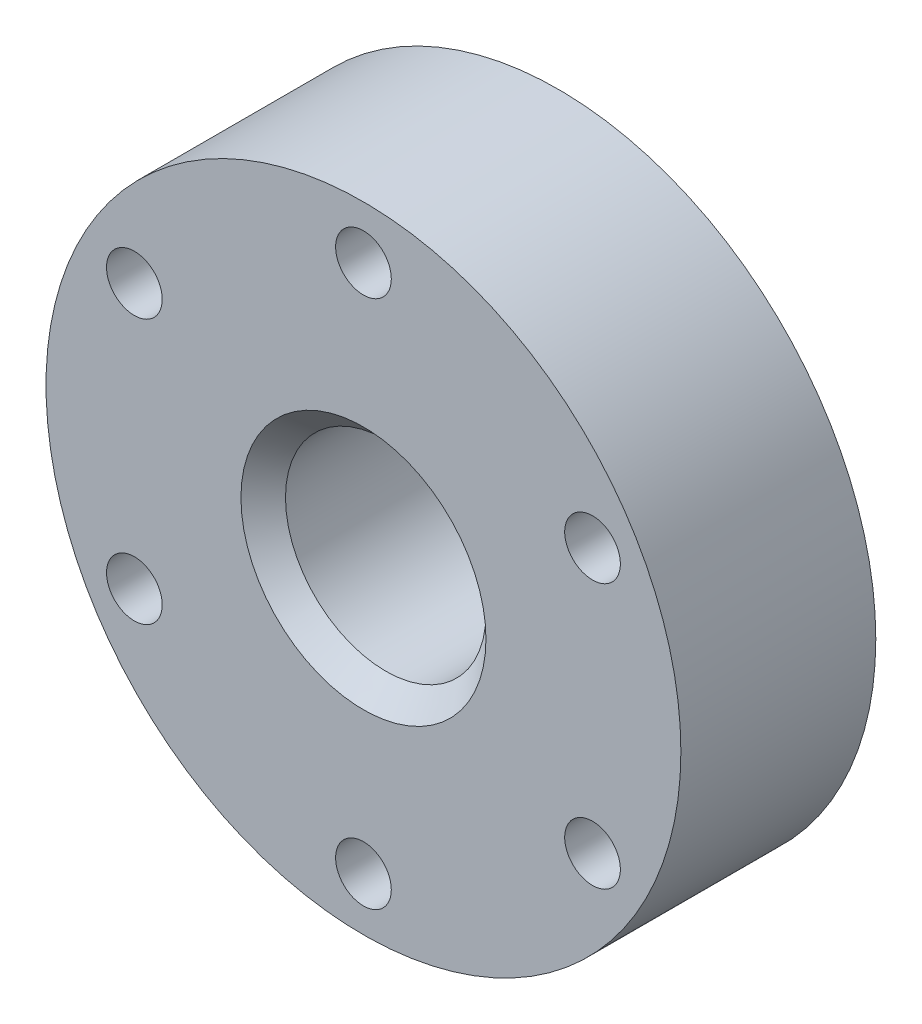
ISO-10303-21;
HEADER;
FILE_DESCRIPTION(('STEP AP214'),'2;1');
FILE_NAME('part.step','',(''),(''),'','','');
FILE_SCHEMA(('AUTOMOTIVE_DESIGN { 1 0 10303 214 1 1 1 1 }'));
ENDSEC;
DATA;
#1=APPLICATION_CONTEXT('core data for automotive mechanical design processes');
#2=APPLICATION_PROTOCOL_DEFINITION('international standard','automotive_design',2000,#1);
#3=PRODUCT_CONTEXT('',#1,'mechanical');
#4=PRODUCT('Part','Part','',(#3));
#5=PRODUCT_RELATED_PRODUCT_CATEGORY('part','',(#4));
#6=PRODUCT_DEFINITION_FORMATION('','',#4);
#7=PRODUCT_DEFINITION_CONTEXT('part definition',#1,'design');
#8=PRODUCT_DEFINITION('design','',#6,#7);
#9=PRODUCT_DEFINITION_SHAPE('','',#8);
#10=(LENGTH_UNIT() NAMED_UNIT(*) SI_UNIT(.MILLI.,.METRE.));
#11=(NAMED_UNIT(*) PLANE_ANGLE_UNIT() SI_UNIT($,.RADIAN.));
#12=(NAMED_UNIT(*) SI_UNIT($,.STERADIAN.) SOLID_ANGLE_UNIT());
#13=UNCERTAINTY_MEASURE_WITH_UNIT(LENGTH_MEASURE(1.E-05),#10,'distance_accuracy_value','');
#14=(GEOMETRIC_REPRESENTATION_CONTEXT(3) GLOBAL_UNCERTAINTY_ASSIGNED_CONTEXT((#13)) GLOBAL_UNIT_ASSIGNED_CONTEXT((#10,
#11,#12)) REPRESENTATION_CONTEXT('',''));
#15=CARTESIAN_POINT('',(0.,0.,0.));
#16=DIRECTION('',(0.,0.,1.));
#17=DIRECTION('',(1.,0.,0.));
#18=AXIS2_PLACEMENT_3D('',#15,#16,#17);
#19=CARTESIAN_POINT('',(0.,0.,17.5));
#20=DIRECTION('',(0.,0.,1.));
#21=DIRECTION('',(1.,0.,0.));
#22=AXIS2_PLACEMENT_3D('',#19,#20,#21);
#23=PLANE('',#22);
#24=CARTESIAN_POINT('',(0.,0.,17.5));
#25=DIRECTION('',(0.,0.,1.));
#26=DIRECTION('',(1.,0.,0.));
#27=AXIS2_PLACEMENT_3D('',#24,#25,#26);
#28=CIRCLE('',#27,11.);
#29=CARTESIAN_POINT('',(11.,0.,17.5));
#30=VERTEX_POINT('',#29);
#31=EDGE_CURVE('E10',#30,#30,#28,.F.);
#32=ORIENTED_EDGE('',*,*,#31,.T.);
#33=EDGE_LOOP('',(#32));
#34=FACE_BOUND('',#33,.T.);
#35=CARTESIAN_POINT('',(-20.5681033398784,-11.8750000000012,17.5));
#36=DIRECTION('',(0.,0.,1.));
#37=DIRECTION('',(1.,0.,0.));
#38=AXIS2_PLACEMENT_3D('',#35,#36,#37);
#39=CIRCLE('',#38,2.50000000000249);
#40=CARTESIAN_POINT('',(-18.0681033398759,-11.8750000000012,17.5));
#41=VERTEX_POINT('',#40);
#42=EDGE_CURVE('E82',#41,#41,#39,.T.);
#43=ORIENTED_EDGE('',*,*,#42,.F.);
#44=EDGE_LOOP('',(#43));
#45=FACE_BOUND('',#44,.T.);
#46=CARTESIAN_POINT('',(20.5681033398824,-11.8749999999988,17.5));
#47=DIRECTION('',(0.,0.,1.));
#48=DIRECTION('',(1.,0.,0.));
#49=AXIS2_PLACEMENT_3D('',#46,#47,#48);
#50=CIRCLE('',#49,2.5000000000017);
#51=CARTESIAN_POINT('',(23.0681033398841,-11.8749999999988,17.5));
#52=VERTEX_POINT('',#51);
#53=EDGE_CURVE('E70',#52,#52,#50,.T.);
#54=ORIENTED_EDGE('',*,*,#53,.F.);
#55=EDGE_LOOP('',(#54));
#56=FACE_BOUND('',#55,.T.);
#57=CARTESIAN_POINT('',(0.,23.75,17.5));
#58=DIRECTION('',(0.,0.,1.));
#59=DIRECTION('',(1.,0.,0.));
#60=AXIS2_PLACEMENT_3D('',#57,#58,#59);
#61=CIRCLE('',#60,2.5);
#62=CARTESIAN_POINT('',(2.5,23.75,17.5));
#63=VERTEX_POINT('',#62);
#64=EDGE_CURVE('E58',#63,#63,#61,.T.);
#65=ORIENTED_EDGE('',*,*,#64,.F.);
#66=EDGE_LOOP('',(#65));
#67=FACE_BOUND('',#66,.T.);
#68=CARTESIAN_POINT('',(0.,0.,17.5));
#69=DIRECTION('',(0.,0.,1.));
#70=DIRECTION('',(1.,0.,0.));
#71=AXIS2_PLACEMENT_3D('',#68,#69,#70);
#72=CIRCLE('',#71,28.5);
#73=CARTESIAN_POINT('',(28.5,0.,17.5));
#74=VERTEX_POINT('',#73);
#75=EDGE_CURVE('E54',#74,#74,#72,.T.);
#76=ORIENTED_EDGE('',*,*,#75,.T.);
#77=EDGE_LOOP('',(#76));
#78=FACE_BOUND('',#77,.T.);
#79=CARTESIAN_POINT('',(20.5681033398811,11.8750000000012,17.5));
#80=DIRECTION('',(0.,0.,1.));
#81=DIRECTION('',(1.,0.,0.));
#82=AXIS2_PLACEMENT_3D('',#79,#80,#81);
#83=CIRCLE('',#82,2.50000000000036);
#84=CARTESIAN_POINT('',(23.0681033398815,11.8750000000012,17.5));
#85=VERTEX_POINT('',#84);
#86=EDGE_CURVE('E64',#85,#85,#83,.T.);
#87=ORIENTED_EDGE('',*,*,#86,.F.);
#88=EDGE_LOOP('',(#87));
#89=FACE_BOUND('',#88,.T.);
#90=CARTESIAN_POINT('',(2.69424532359243E-12,-23.75,17.5));
#91=DIRECTION('',(0.,0.,1.));
#92=DIRECTION('',(1.,0.,0.));
#93=AXIS2_PLACEMENT_3D('',#90,#91,#92);
#94=CIRCLE('',#93,2.50000000000274);
#95=CARTESIAN_POINT('',(2.50000000000543,-23.75,17.5));
#96=VERTEX_POINT('',#95);
#97=EDGE_CURVE('E76',#96,#96,#94,.T.);
#98=ORIENTED_EDGE('',*,*,#97,.F.);
#99=EDGE_LOOP('',(#98));
#100=FACE_BOUND('',#99,.T.);
#101=CARTESIAN_POINT('',(-20.5681033398798,11.8749999999988,17.5));
#102=DIRECTION('',(0.,0.,1.));
#103=DIRECTION('',(1.,0.,0.));
#104=AXIS2_PLACEMENT_3D('',#101,#102,#103);
#105=CIRCLE('',#104,2.50000000000126);
#106=CARTESIAN_POINT('',(-18.0681033398785,11.8749999999988,17.5));
#107=VERTEX_POINT('',#106);
#108=EDGE_CURVE('E88',#107,#107,#105,.T.);
#109=ORIENTED_EDGE('',*,*,#108,.F.);
#110=EDGE_LOOP('',(#109));
#111=FACE_BOUND('',#110,.T.);
#112=ADVANCED_FACE('F34',(#34,#45,#56,#67,#78,#89,#100,#111),#23,.T.);
#113=CARTESIAN_POINT('',(0.,0.,0.));
#114=DIRECTION('',(0.,0.,1.));
#115=DIRECTION('',(1.,0.,0.));
#116=AXIS2_PLACEMENT_3D('',#113,#114,#115);
#117=PLANE('',#116);
#118=CARTESIAN_POINT('',(0.,0.,0.));
#119=DIRECTION('',(0.,0.,1.));
#120=DIRECTION('',(1.,0.,0.));
#121=AXIS2_PLACEMENT_3D('',#118,#119,#120);
#122=CIRCLE('',#121,11.);
#123=CARTESIAN_POINT('',(11.,0.,0.));
#124=VERTEX_POINT('',#123);
#125=EDGE_CURVE('E49',#124,#124,#122,.T.);
#126=ORIENTED_EDGE('',*,*,#125,.T.);
#127=EDGE_LOOP('',(#126));
#128=FACE_BOUND('',#127,.T.);
#129=CARTESIAN_POINT('',(0.,0.,0.));
#130=DIRECTION('',(0.,0.,1.));
#131=DIRECTION('',(1.,0.,0.));
#132=AXIS2_PLACEMENT_3D('',#129,#130,#131);
#133=CIRCLE('',#132,28.5);
#134=CARTESIAN_POINT('',(28.5,0.,0.));
#135=VERTEX_POINT('',#134);
#136=EDGE_CURVE('E55',#135,#135,#133,.T.);
#137=ORIENTED_EDGE('',*,*,#136,.F.);
#138=EDGE_LOOP('',(#137));
#139=FACE_BOUND('',#138,.T.);
#140=CARTESIAN_POINT('',(0.,23.75,0.));
#141=DIRECTION('',(0.,0.,1.));
#142=DIRECTION('',(1.,0.,0.));
#143=AXIS2_PLACEMENT_3D('',#140,#141,#142);
#144=CIRCLE('',#143,2.5);
#145=CARTESIAN_POINT('',(2.5,23.75,0.));
#146=VERTEX_POINT('',#145);
#147=EDGE_CURVE('E61',#146,#146,#144,.T.);
#148=ORIENTED_EDGE('',*,*,#147,.T.);
#149=EDGE_LOOP('',(#148));
#150=FACE_BOUND('',#149,.T.);
#151=CARTESIAN_POINT('',(20.5681033398811,11.8750000000012,0.));
#152=DIRECTION('',(0.,0.,1.));
#153=DIRECTION('',(1.,0.,0.));
#154=AXIS2_PLACEMENT_3D('',#151,#152,#153);
#155=CIRCLE('',#154,2.50000000000036);
#156=CARTESIAN_POINT('',(23.0681033398815,11.8750000000012,0.));
#157=VERTEX_POINT('',#156);
#158=EDGE_CURVE('E67',#157,#157,#155,.T.);
#159=ORIENTED_EDGE('',*,*,#158,.T.);
#160=EDGE_LOOP('',(#159));
#161=FACE_BOUND('',#160,.T.);
#162=CARTESIAN_POINT('',(20.5681033398824,-11.8749999999988,0.));
#163=DIRECTION('',(0.,0.,1.));
#164=DIRECTION('',(1.,0.,0.));
#165=AXIS2_PLACEMENT_3D('',#162,#163,#164);
#166=CIRCLE('',#165,2.5000000000017);
#167=CARTESIAN_POINT('',(23.0681033398841,-11.8749999999988,0.));
#168=VERTEX_POINT('',#167);
#169=EDGE_CURVE('E73',#168,#168,#166,.T.);
#170=ORIENTED_EDGE('',*,*,#169,.T.);
#171=EDGE_LOOP('',(#170));
#172=FACE_BOUND('',#171,.T.);
#173=CARTESIAN_POINT('',(2.69424532359243E-12,-23.75,0.));
#174=DIRECTION('',(0.,0.,1.));
#175=DIRECTION('',(1.,0.,0.));
#176=AXIS2_PLACEMENT_3D('',#173,#174,#175);
#177=CIRCLE('',#176,2.50000000000274);
#178=CARTESIAN_POINT('',(2.50000000000543,-23.75,0.));
#179=VERTEX_POINT('',#178);
#180=EDGE_CURVE('E79',#179,#179,#177,.T.);
#181=ORIENTED_EDGE('',*,*,#180,.T.);
#182=EDGE_LOOP('',(#181));
#183=FACE_BOUND('',#182,.T.);
#184=CARTESIAN_POINT('',(-20.5681033398784,-11.8750000000012,0.));
#185=DIRECTION('',(0.,0.,1.));
#186=DIRECTION('',(1.,0.,0.));
#187=AXIS2_PLACEMENT_3D('',#184,#185,#186);
#188=CIRCLE('',#187,2.50000000000249);
#189=CARTESIAN_POINT('',(-18.0681033398759,-11.8750000000012,0.));
#190=VERTEX_POINT('',#189);
#191=EDGE_CURVE('E85',#190,#190,#188,.T.);
#192=ORIENTED_EDGE('',*,*,#191,.T.);
#193=EDGE_LOOP('',(#192));
#194=FACE_BOUND('',#193,.T.);
#195=CARTESIAN_POINT('',(-20.5681033398798,11.8749999999988,0.));
#196=DIRECTION('',(0.,0.,1.));
#197=DIRECTION('',(1.,0.,0.));
#198=AXIS2_PLACEMENT_3D('',#195,#196,#197);
#199=CIRCLE('',#198,2.50000000000126);
#200=CARTESIAN_POINT('',(-18.0681033398785,11.8749999999988,0.));
#201=VERTEX_POINT('',#200);
#202=EDGE_CURVE('E91',#201,#201,#199,.T.);
#203=ORIENTED_EDGE('',*,*,#202,.T.);
#204=EDGE_LOOP('',(#203));
#205=FACE_BOUND('',#204,.T.);
#206=ADVANCED_FACE('F101',(#128,#139,#150,#161,#172,#183,#194,#205),#117,.F.);
#207=CARTESIAN_POINT('',(0.,0.,17.5));
#208=DIRECTION('',(0.,0.,-1.));
#209=DIRECTION('',(-1.,0.,0.));
#210=AXIS2_PLACEMENT_3D('',#207,#208,#209);
#211=CYLINDRICAL_SURFACE('',#210,28.5);
#212=ORIENTED_EDGE('',*,*,#75,.F.);
#213=EDGE_LOOP('',(#212));
#214=FACE_BOUND('',#213,.T.);
#215=ORIENTED_EDGE('',*,*,#136,.T.);
#216=EDGE_LOOP('',(#215));
#217=FACE_BOUND('',#216,.T.);
#218=ADVANCED_FACE('F106',(#214,#217),#211,.T.);
#219=CARTESIAN_POINT('',(0.,23.75,17.5));
#220=DIRECTION('',(0.,0.,-1.));
#221=DIRECTION('',(-1.,0.,0.));
#222=AXIS2_PLACEMENT_3D('',#219,#220,#221);
#223=CYLINDRICAL_SURFACE('',#222,2.5);
#224=ORIENTED_EDGE('',*,*,#64,.T.);
#225=EDGE_LOOP('',(#224));
#226=FACE_BOUND('',#225,.T.);
#227=ORIENTED_EDGE('',*,*,#147,.F.);
#228=EDGE_LOOP('',(#227));
#229=FACE_BOUND('',#228,.T.);
#230=ADVANCED_FACE('F111',(#226,#229),#223,.F.);
#231=CARTESIAN_POINT('',(20.5681033398811,11.8750000000012,17.5));
#232=DIRECTION('',(0.,0.,-1.));
#233=DIRECTION('',(-1.,0.,0.));
#234=AXIS2_PLACEMENT_3D('',#231,#232,#233);
#235=CYLINDRICAL_SURFACE('',#234,2.50000000000036);
#236=ORIENTED_EDGE('',*,*,#86,.T.);
#237=EDGE_LOOP('',(#236));
#238=FACE_BOUND('',#237,.T.);
#239=ORIENTED_EDGE('',*,*,#158,.F.);
#240=EDGE_LOOP('',(#239));
#241=FACE_BOUND('',#240,.T.);
#242=ADVANCED_FACE('F157',(#238,#241),#235,.F.);
#243=CARTESIAN_POINT('',(20.5681033398824,-11.8749999999988,17.5));
#244=DIRECTION('',(0.,0.,-1.));
#245=DIRECTION('',(-1.,0.,0.));
#246=AXIS2_PLACEMENT_3D('',#243,#244,#245);
#247=CYLINDRICAL_SURFACE('',#246,2.5000000000017);
#248=ORIENTED_EDGE('',*,*,#53,.T.);
#249=EDGE_LOOP('',(#248));
#250=FACE_BOUND('',#249,.T.);
#251=ORIENTED_EDGE('',*,*,#169,.F.);
#252=EDGE_LOOP('',(#251));
#253=FACE_BOUND('',#252,.T.);
#254=ADVANCED_FACE('F154',(#250,#253),#247,.F.);
#255=CARTESIAN_POINT('',(2.69424532359243E-12,-23.75,17.5));
#256=DIRECTION('',(0.,0.,-1.));
#257=DIRECTION('',(-1.,0.,0.));
#258=AXIS2_PLACEMENT_3D('',#255,#256,#257);
#259=CYLINDRICAL_SURFACE('',#258,2.50000000000274);
#260=ORIENTED_EDGE('',*,*,#97,.T.);
#261=EDGE_LOOP('',(#260));
#262=FACE_BOUND('',#261,.T.);
#263=ORIENTED_EDGE('',*,*,#180,.F.);
#264=EDGE_LOOP('',(#263));
#265=FACE_BOUND('',#264,.T.);
#266=ADVANCED_FACE('F148',(#262,#265),#259,.F.);
#267=CARTESIAN_POINT('',(-20.5681033398784,-11.8750000000012,17.5));
#268=DIRECTION('',(0.,0.,-1.));
#269=DIRECTION('',(-1.,0.,0.));
#270=AXIS2_PLACEMENT_3D('',#267,#268,#269);
#271=CYLINDRICAL_SURFACE('',#270,2.50000000000249);
#272=ORIENTED_EDGE('',*,*,#42,.T.);
#273=EDGE_LOOP('',(#272));
#274=FACE_BOUND('',#273,.T.);
#275=ORIENTED_EDGE('',*,*,#191,.F.);
#276=EDGE_LOOP('',(#275));
#277=FACE_BOUND('',#276,.T.);
#278=ADVANCED_FACE('F143',(#274,#277),#271,.F.);
#279=CARTESIAN_POINT('',(-20.5681033398798,11.8749999999988,17.5));
#280=DIRECTION('',(0.,0.,-1.));
#281=DIRECTION('',(-1.,0.,0.));
#282=AXIS2_PLACEMENT_3D('',#279,#280,#281);
#283=CYLINDRICAL_SURFACE('',#282,2.50000000000126);
#284=ORIENTED_EDGE('',*,*,#108,.T.);
#285=EDGE_LOOP('',(#284));
#286=FACE_BOUND('',#285,.T.);
#287=ORIENTED_EDGE('',*,*,#202,.F.);
#288=EDGE_LOOP('',(#287));
#289=FACE_BOUND('',#288,.T.);
#290=ADVANCED_FACE('F97',(#286,#289),#283,.F.);
#291=CARTESIAN_POINT('',(0.,0.,0.));
#292=DIRECTION('',(0.,0.,1.));
#293=DIRECTION('',(1.,0.,0.));
#294=AXIS2_PLACEMENT_3D('',#291,#292,#293);
#295=CYLINDRICAL_SURFACE('',#294,9.);
#296=CARTESIAN_POINT('',(0.,0.,1.99999999999999));
#297=DIRECTION('',(0.,0.,1.));
#298=DIRECTION('',(1.,0.,0.));
#299=AXIS2_PLACEMENT_3D('',#296,#297,#298);
#300=CIRCLE('',#299,9.);
#301=CARTESIAN_POINT('',(9.,0.,1.99999999999999));
#302=VERTEX_POINT('',#301);
#303=EDGE_CURVE('E41',#302,#302,#300,.F.);
#304=ORIENTED_EDGE('',*,*,#303,.T.);
#305=EDGE_LOOP('',(#304));
#306=FACE_BOUND('',#305,.T.);
#307=CARTESIAN_POINT('',(0.,0.,15.5));
#308=DIRECTION('',(0.,0.,1.));
#309=DIRECTION('',(1.,0.,0.));
#310=AXIS2_PLACEMENT_3D('',#307,#308,#309);
#311=CIRCLE('',#310,9.);
#312=CARTESIAN_POINT('',(9.,0.,15.5));
#313=VERTEX_POINT('',#312);
#314=EDGE_CURVE('E45',#313,#313,#311,.T.);
#315=ORIENTED_EDGE('',*,*,#314,.T.);
#316=EDGE_LOOP('',(#315));
#317=FACE_BOUND('',#316,.T.);
#318=ADVANCED_FACE('F118',(#306,#317),#295,.F.);
#319=CARTESIAN_POINT('',(0.,0.,0.));
#320=DIRECTION('',(0.,0.,-1.));
#321=DIRECTION('',(-1.,0.,0.));
#322=AXIS2_PLACEMENT_3D('',#319,#320,#321);
#323=CONICAL_SURFACE('',#322,11.,0.785398163397447);
#324=ORIENTED_EDGE('',*,*,#303,.F.);
#325=EDGE_LOOP('',(#324));
#326=FACE_BOUND('',#325,.T.);
#327=ORIENTED_EDGE('',*,*,#125,.F.);
#328=EDGE_LOOP('',(#327));
#329=FACE_BOUND('',#328,.T.);
#330=ADVANCED_FACE('F116',(#326,#329),#323,.F.);
#331=CARTESIAN_POINT('',(0.,0.,15.5));
#332=DIRECTION('',(0.,0.,1.));
#333=DIRECTION('',(1.,0.,0.));
#334=AXIS2_PLACEMENT_3D('',#331,#332,#333);
#335=CONICAL_SURFACE('',#334,9.,0.785398163397453);
#336=ORIENTED_EDGE('',*,*,#31,.F.);
#337=EDGE_LOOP('',(#336));
#338=FACE_BOUND('',#337,.T.);
#339=ORIENTED_EDGE('',*,*,#314,.F.);
#340=EDGE_LOOP('',(#339));
#341=FACE_BOUND('',#340,.T.);
#342=ADVANCED_FACE('F36',(#338,#341),#335,.F.);
#343=CLOSED_SHELL('',(#112,#206,#218,#230,#242,#254,#266,#278,#290,#318,#330,#342));
#344=MANIFOLD_SOLID_BREP('B2',#343);
#345=ADVANCED_BREP_SHAPE_REPRESENTATION('',(#18,#344),#14);
#346=SHAPE_DEFINITION_REPRESENTATION(#9,#345);
ENDSEC;
END-ISO-10303-21;
